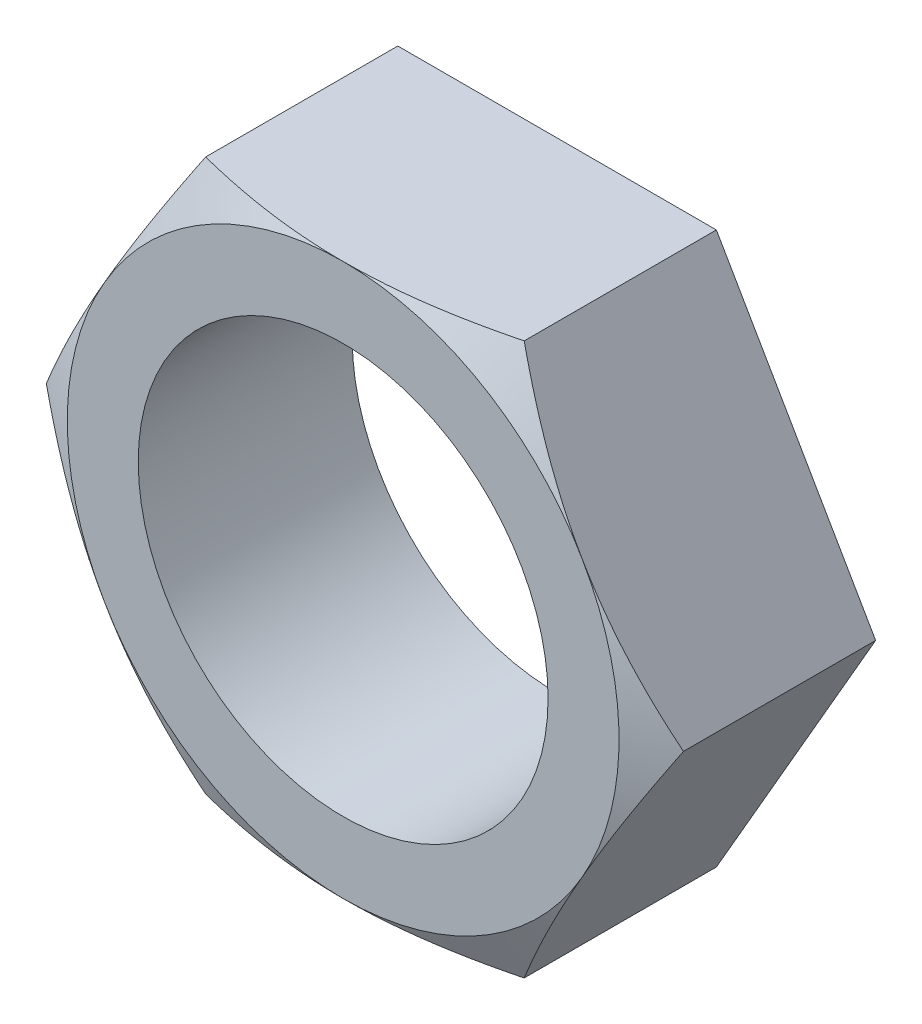
ISO-10303-21;
HEADER;
FILE_DESCRIPTION(('STEP AP214'),'2;1');
FILE_NAME('part.step','',(''),(''),'','','');
FILE_SCHEMA(('AUTOMOTIVE_DESIGN { 1 0 10303 214 1 1 1 1 }'));
ENDSEC;
DATA;
#1=APPLICATION_CONTEXT('core data for automotive mechanical design processes');
#2=APPLICATION_PROTOCOL_DEFINITION('international standard','automotive_design',2000,#1);
#3=PRODUCT_CONTEXT('',#1,'mechanical');
#4=PRODUCT('Part','Part','',(#3));
#5=PRODUCT_RELATED_PRODUCT_CATEGORY('part','',(#4));
#6=PRODUCT_DEFINITION_FORMATION('','',#4);
#7=PRODUCT_DEFINITION_CONTEXT('part definition',#1,'design');
#8=PRODUCT_DEFINITION('design','',#6,#7);
#9=PRODUCT_DEFINITION_SHAPE('','',#8);
#10=(LENGTH_UNIT() NAMED_UNIT(*) SI_UNIT(.MILLI.,.METRE.));
#11=(NAMED_UNIT(*) PLANE_ANGLE_UNIT() SI_UNIT($,.RADIAN.));
#12=(NAMED_UNIT(*) SI_UNIT($,.STERADIAN.) SOLID_ANGLE_UNIT());
#13=UNCERTAINTY_MEASURE_WITH_UNIT(LENGTH_MEASURE(1.E-05),#10,'distance_accuracy_value','');
#14=(GEOMETRIC_REPRESENTATION_CONTEXT(3) GLOBAL_UNCERTAINTY_ASSIGNED_CONTEXT((#13)) GLOBAL_UNIT_ASSIGNED_CONTEXT((#10,
#11,#12)) REPRESENTATION_CONTEXT('',''));
#15=CARTESIAN_POINT('',(0.,0.,0.));
#16=DIRECTION('',(0.,0.,1.));
#17=DIRECTION('',(1.,0.,0.));
#18=AXIS2_PLACEMENT_3D('',#15,#16,#17);
#19=CARTESIAN_POINT('',(147.07060395356,1381.2218281699,123.976608288254));
#20=DIRECTION('',(0.866025403784434,-0.500000000000007,0.));
#21=DIRECTION('',(0.500000000000007,0.866025403784434,0.));
#22=AXIS2_PLACEMENT_3D('',#19,#20,#21);
#23=PLANE('',#22);
#24=CARTESIAN_POINT('',(147.070719423614,1381.2220281699,21.3919278692892));
#25=CARTESIAN_POINT('',(146.580470792881,1380.37289263313,21.6417046290043));
#26=CARTESIAN_POINT('',(146.088283996036,1379.52040009418,21.8769733663679));
#27=CARTESIAN_POINT('',(145.099927293063,1377.80851606863,22.3137023874053));
#28=CARTESIAN_POINT('',(144.603755497762,1376.94912130988,22.5151455063238));
#29=CARTESIAN_POINT('',(143.607012208054,1375.22271129001,22.8794628681463));
#30=CARTESIAN_POINT('',(143.10643489137,1374.35568594439,23.0422741440836));
#31=CARTESIAN_POINT('',(142.102261938455,1372.61640737036,23.3240694413077));
#32=CARTESIAN_POINT('',(141.598666825295,1371.74415504792,23.4430608465895));
#33=CARTESIAN_POINT('',(140.600914799346,1370.01599784562,23.6310032152789));
#34=CARTESIAN_POINT('',(140.106810058655,1369.16018333049,23.7010513372338));
#35=CARTESIAN_POINT('',(139.117443596861,1367.44655035135,23.7929958306863));
#36=CARTESIAN_POINT('',(138.622181822608,1366.5887317953,23.8148899448458));
#37=CARTESIAN_POINT('',(137.632281032135,1364.87417333175,23.8096982247025));
#38=CARTESIAN_POINT('',(137.137641937828,1364.017433289,23.782667033308));
#39=CARTESIAN_POINT('',(136.14963623759,1362.30615721802,23.6807404823272));
#40=CARTESIAN_POINT('',(135.656269529059,1361.45162101208,23.6058491113049));
#41=CARTESIAN_POINT('',(134.919890015754,1360.17617428138,23.4600252252282));
#42=CARTESIAN_POINT('',(134.6760003469,1359.75374498349,23.4061148153264));
#43=CARTESIAN_POINT('',(134.188884668478,1358.9100358793,23.2876390773393));
#44=CARTESIAN_POINT('',(133.945658615883,1358.48875599848,23.2230744575704));
#45=CARTESIAN_POINT('',(133.21699643025,1357.22667607141,23.0140896973095));
#46=CARTESIAN_POINT('',(132.73264065915,1356.38774726692,22.8543916470237));
#47=CARTESIAN_POINT('',(131.761505215448,1354.7056913374,22.4964947671884));
#48=CARTESIAN_POINT('',(131.274766865267,1353.8626357849,22.2978544405525));
#49=CARTESIAN_POINT('',(130.30516492159,1352.18323595533,21.8680955136689));
#50=CARTESIAN_POINT('',(129.822299286033,1351.34688814132,21.6369954077479));
#51=CARTESIAN_POINT('',(129.341288483506,1350.51375299235,21.3919278692892));
#52=B_SPLINE_CURVE_WITH_KNOTS('',3,(#24,#25,#26,#27,#28,#29,#30,#31,#32,#33,#34,#35,#36,#37,#38,
#39,#40,#41,#42,#43,#44,#45,#46,#47,#48,#49,#50,#51),.UNSPECIFIED.,.F.,.F.,(4,2,2,2,2,2,2,2,2,2,
2,2,2,4),(0.,3.03558638203784,6.07270854259094,9.11474748966,12.1562735942813,15.1272181043355,
18.0983018817831,21.0660694103388,24.0335896438093,25.5057384868417,26.9777894974265,
29.922279495167,32.9023144399483,35.8806583121157),.UNSPECIFIED.);
#53=CARTESIAN_POINT('',(147.07060395356,1381.2218281699,21.3919867045077));
#54=VERTEX_POINT('',#53);
#55=CARTESIAN_POINT('',(138.20600395356,1365.86789058112,23.8125000000008));
#56=VERTEX_POINT('',#55);
#57=EDGE_CURVE('E121',#54,#56,#52,.T.);
#58=ORIENTED_EDGE('',*,*,#57,.F.);
#59=DIRECTION('',(0.,0.,-1.));
#60=VECTOR('',#59,1.);
#61=CARTESIAN_POINT('',(147.07060395356,1381.2218281699,123.976608288254));
#62=LINE('',#61,#60);
#63=CARTESIAN_POINT('',(147.07060395356,1381.2218281699,0.));
#64=VERTEX_POINT('',#63);
#65=EDGE_CURVE('E251',#54,#64,#62,.T.);
#66=ORIENTED_EDGE('',*,*,#65,.T.);
#67=DIRECTION('',(-0.500000000000007,-0.866025403784434,0.));
#68=VECTOR('',#67,1.);
#69=CARTESIAN_POINT('',(147.07060395356,1381.2218281699,0.));
#70=LINE('',#69,#68);
#71=CARTESIAN_POINT('',(129.34140395356,1350.51395299235,0.));
#72=VERTEX_POINT('',#71);
#73=EDGE_CURVE('E252',#64,#72,#70,.T.);
#74=ORIENTED_EDGE('',*,*,#73,.T.);
#75=DIRECTION('',(0.,0.,-1.));
#76=VECTOR('',#75,1.);
#77=CARTESIAN_POINT('',(129.34140395356,1350.51395299235,123.976608288254));
#78=LINE('',#77,#76);
#79=CARTESIAN_POINT('',(129.34140395356,1350.51395299235,21.3919867045076));
#80=VERTEX_POINT('',#79);
#81=EDGE_CURVE('E149',#80,#72,#78,.T.);
#82=ORIENTED_EDGE('',*,*,#81,.F.);
#83=EDGE_CURVE('E132',#56,#80,#52,.T.);
#84=ORIENTED_EDGE('',*,*,#83,.F.);
#85=EDGE_LOOP('',(#58,#66,#74,#82,#84));
#86=FACE_BOUND('',#85,.T.);
#87=ADVANCED_FACE('F49',(#86),#23,.F.);
#88=CARTESIAN_POINT('',(129.34140395356,1350.51395299235,123.976608288254));
#89=DIRECTION('',(0.866025403784442,0.499999999999994,0.));
#90=DIRECTION('',(-0.499999999999994,0.866025403784442,0.));
#91=AXIS2_PLACEMENT_3D('',#88,#89,#90);
#92=PLANE('',#91);
#93=CARTESIAN_POINT('',(129.341288483506,1350.51415299235,21.3919278692892));
#94=CARTESIAN_POINT('',(129.831537114238,1349.66501745558,21.6417046290042));
#95=CARTESIAN_POINT('',(130.323723911084,1348.81252491663,21.8769733663678));
#96=CARTESIAN_POINT('',(131.312080614057,1347.10064089108,22.3137023874053));
#97=CARTESIAN_POINT('',(131.808252409357,1346.24124613233,22.5151455063237));
#98=CARTESIAN_POINT('',(132.804995699065,1344.51483611246,22.8794628681462));
#99=CARTESIAN_POINT('',(133.30557301575,1343.64781076684,23.0422741440836));
#100=CARTESIAN_POINT('',(134.309745968665,1341.90853219281,23.3240694413077));
#101=CARTESIAN_POINT('',(134.813341081825,1341.03627987037,23.4430608465895));
#102=CARTESIAN_POINT('',(135.811093107774,1339.30812266807,23.6310032152788));
#103=CARTESIAN_POINT('',(136.305197848465,1338.45230815294,23.7010513372338));
#104=CARTESIAN_POINT('',(137.294564310259,1336.7386751738,23.7929958306862));
#105=CARTESIAN_POINT('',(137.789826084512,1335.88085661775,23.8148899448458));
#106=CARTESIAN_POINT('',(138.779726874984,1334.1662981542,23.8096982247025));
#107=CARTESIAN_POINT('',(139.274365969291,1333.30955811145,23.782667033308));
#108=CARTESIAN_POINT('',(140.26237166953,1331.59828204047,23.6807404823272));
#109=CARTESIAN_POINT('',(140.75573837806,1330.74374583453,23.6058491113049));
#110=CARTESIAN_POINT('',(141.492117891365,1329.46829910383,23.4600252252282));
#111=CARTESIAN_POINT('',(141.73600756022,1329.04586980594,23.4061148153264));
#112=CARTESIAN_POINT('',(142.223123238642,1328.20216070175,23.2876390773393));
#113=CARTESIAN_POINT('',(142.466349291236,1327.78088082093,23.2230744575704));
#114=CARTESIAN_POINT('',(143.195011476869,1326.51880089386,23.0140896973095));
#115=CARTESIAN_POINT('',(143.679367247969,1325.67987208937,22.8543916470237));
#116=CARTESIAN_POINT('',(144.650502691672,1323.99781615985,22.4964947671883));
#117=CARTESIAN_POINT('',(145.137241041852,1323.15476060735,22.2978544405525));
#118=CARTESIAN_POINT('',(146.10684298553,1321.47536077778,21.8680955136689));
#119=CARTESIAN_POINT('',(146.589708621086,1320.63901296377,21.6369954077479));
#120=CARTESIAN_POINT('',(147.070719423613,1319.8058778148,21.3919278692892));
#121=B_SPLINE_CURVE_WITH_KNOTS('',3,(#93,#94,#95,#96,#97,#98,#99,#100,#101,#102,#103,#104,#105,
#106,#107,#108,#109,#110,#111,#112,#113,#114,#115,#116,#117,#118,#119,#120),.UNSPECIFIED.,.F.,
.F.,(4,2,2,2,2,2,2,2,2,2,2,2,2,4),(0.,3.03558638203781,6.0727085425909,9.11474748965993,
12.1562735942812,15.1272181043356,18.0983018817832,21.0660694103389,24.0335896438094,
25.5057384868415,26.9777894974267,29.9222794951672,32.9023144399483,35.8806583121156),.UNSPECIFIED.);
#122=CARTESIAN_POINT('',(138.20600395356,1335.16001540357,23.8125000000008));
#123=VERTEX_POINT('',#122);
#124=EDGE_CURVE('E139',#80,#123,#121,.T.);
#125=ORIENTED_EDGE('',*,*,#124,.F.);
#126=ORIENTED_EDGE('',*,*,#81,.T.);
#127=DIRECTION('',(0.499999999999994,-0.866025403784442,0.));
#128=VECTOR('',#127,1.);
#129=CARTESIAN_POINT('',(129.34140395356,1350.51395299235,0.));
#130=LINE('',#129,#128);
#131=CARTESIAN_POINT('',(147.070603953559,1319.8060778148,0.));
#132=VERTEX_POINT('',#131);
#133=EDGE_CURVE('E267',#72,#132,#130,.T.);
#134=ORIENTED_EDGE('',*,*,#133,.T.);
#135=DIRECTION('',(0.,0.,-1.));
#136=VECTOR('',#135,1.);
#137=CARTESIAN_POINT('',(147.070603953559,1319.8060778148,123.976608288254));
#138=LINE('',#137,#136);
#139=CARTESIAN_POINT('',(147.070603953559,1319.8060778148,21.3919867045077));
#140=VERTEX_POINT('',#139);
#141=EDGE_CURVE('E222',#140,#132,#138,.T.);
#142=ORIENTED_EDGE('',*,*,#141,.F.);
#143=EDGE_CURVE('E150',#123,#140,#121,.T.);
#144=ORIENTED_EDGE('',*,*,#143,.F.);
#145=EDGE_LOOP('',(#125,#126,#134,#142,#144));
#146=FACE_BOUND('',#145,.T.);
#147=ADVANCED_FACE('F210',(#146),#92,.F.);
#148=CARTESIAN_POINT('',(147.070603953559,1319.8060778148,123.976608288254));
#149=DIRECTION('',(0.,1.,0.));
#150=DIRECTION('',(-1.,0.,0.));
#151=AXIS2_PLACEMENT_3D('',#148,#149,#150);
#152=PLANE('',#151);
#153=CARTESIAN_POINT('',(117.771709021794,1319.8060778148,10.8409567621768));
#154=CARTESIAN_POINT('',(118.456911807854,1319.8060778148,11.1332749209905));
#155=CARTESIAN_POINT('',(119.142799303296,1319.8060778148,11.4239930974424));
#156=CARTESIAN_POINT('',(120.516086699451,1319.8060778148,12.001852866436));
#157=CARTESIAN_POINT('',(121.203486614713,1319.8060778148,12.2889944243928));
#158=CARTESIAN_POINT('',(122.580027360718,1319.8060778148,12.8593595943776));
#159=CARTESIAN_POINT('',(123.269168427127,1319.8060778148,13.1425826382681));
#160=CARTESIAN_POINT('',(124.649244401776,1319.8060778148,13.7046161150412));
#161=CARTESIAN_POINT('',(125.340179305927,1319.8060778148,13.9834265579677));
#162=CARTESIAN_POINT('',(127.421796474031,1319.8060778148,14.8148516356537));
#163=CARTESIAN_POINT('',(128.815462549204,1319.8060778148,15.3600354664249));
#164=CARTESIAN_POINT('',(131.612197010711,1319.8060778148,16.42563880378));
#165=CARTESIAN_POINT('',(133.0152650062,1319.8060778148,16.9460593325986));
#166=CARTESIAN_POINT('',(135.823309352538,1319.8060778148,17.9522574166504));
#167=CARTESIAN_POINT('',(137.228211056339,1319.8060778148,18.4382422110898));
#168=CARTESIAN_POINT('',(140.0511762563,1319.8060778148,19.3710139959994));
#169=CARTESIAN_POINT('',(141.469240674678,1319.8060778148,19.8177982166875));
#170=CARTESIAN_POINT('',(144.31828348994,1319.8060778148,20.6608160664175));
#171=CARTESIAN_POINT('',(145.749241074345,1319.8060778148,21.0571194547956));
#172=CARTESIAN_POINT('',(148.627149973403,1319.8060778148,21.7866205817215));
#173=CARTESIAN_POINT('',(150.074098105683,1319.8060778148,22.1198306457246));
#174=CARTESIAN_POINT('',(152.430331648247,1319.8060778148,22.5960899015803));
#175=CARTESIAN_POINT('',(153.334752254528,1319.8060778148,22.7632580244041));
#176=CARTESIAN_POINT('',(155.149219008547,1319.8060778148,23.0638467167844));
#177=CARTESIAN_POINT('',(156.059265017458,1319.8060778148,23.197268115783));
#178=CARTESIAN_POINT('',(157.883835527958,1319.8060778148,23.42691192005));
#179=CARTESIAN_POINT('',(158.798358805228,1319.8060778148,23.5231439759794));
#180=CARTESIAN_POINT('',(160.630757944938,1319.8060778148,23.6756764225213));
#181=CARTESIAN_POINT('',(161.548633791425,1319.8060778148,23.7319770028961));
#182=CARTESIAN_POINT('',(163.386507442713,1319.8060778148,23.8029000926338));
#183=CARTESIAN_POINT('',(164.306506126316,1319.8060778148,23.8175000573444));
#184=CARTESIAN_POINT('',(166.146199021455,1319.8060778148,23.8044811571944));
#185=CARTESIAN_POINT('',(167.0658932338,1319.8060778148,23.7768624054369));
#186=CARTESIAN_POINT('',(168.902986176128,1319.8060778148,23.6803064355593));
#187=CARTESIAN_POINT('',(169.8203851506,1319.8060778148,23.6113738243276));
#188=CARTESIAN_POINT('',(171.651374475858,1319.8060778148,23.4343128406343));
#189=CARTESIAN_POINT('',(172.564964743128,1319.8060778148,23.3261836132155));
#190=CARTESIAN_POINT('',(174.447081201838,1319.8060778148,23.0654414898965));
#191=CARTESIAN_POINT('',(175.415264447843,1319.8060778148,22.9103687047686));
#192=CARTESIAN_POINT('',(177.345078154972,1319.8060778148,22.5634158118414));
#193=CARTESIAN_POINT('',(178.306707777592,1319.8060778148,22.3715310823994));
#194=CARTESIAN_POINT('',(180.223431339038,1319.8060778148,21.9553572065387));
#195=CARTESIAN_POINT('',(181.178521416784,1319.8060778148,21.7310503993854));
#196=CARTESIAN_POINT('',(183.081624184154,1319.8060778148,21.2544637660428));
#197=CARTESIAN_POINT('',(184.029637085254,1319.8060778148,21.0021847793025));
#198=CARTESIAN_POINT('',(185.923233455325,1319.8060778148,20.4724108102008));
#199=CARTESIAN_POINT('',(186.868785994329,1319.8060778148,20.1948058011185));
#200=CARTESIAN_POINT('',(188.753554148018,1319.8060778148,19.6189165178223));
#201=CARTESIAN_POINT('',(189.69276971916,1319.8060778148,19.3206321016725));
#202=CARTESIAN_POINT('',(191.565169477271,1319.8060778148,18.7065206757264));
#203=CARTESIAN_POINT('',(192.498355112009,1319.8060778148,18.3906980658482));
#204=CARTESIAN_POINT('',(194.359492154287,1319.8060778148,17.7440384241465));
#205=CARTESIAN_POINT('',(195.287443579258,1319.8060778148,17.4132014423559));
#206=CARTESIAN_POINT('',(197.155106522538,1319.8060778148,16.7327061537367));
#207=CARTESIAN_POINT('',(198.094734079441,1319.8060778148,16.3828178891692));
#208=CARTESIAN_POINT('',(199.969673141043,1319.8060778148,15.6716813356268));
#209=CARTESIAN_POINT('',(200.904984642862,1319.8060778148,15.3104330390735));
#210=CARTESIAN_POINT('',(202.771843288172,1319.8060778148,14.5781611036866));
#211=CARTESIAN_POINT('',(203.703390162497,1319.8060778148,14.2071367796587));
#212=CARTESIAN_POINT('',(205.563092524498,1319.8060778148,13.4566813214079));
#213=CARTESIAN_POINT('',(206.491247995723,1319.8060778148,13.077250146469));
#214=CARTESIAN_POINT('',(208.333979859002,1319.8060778148,12.315478714202));
#215=CARTESIAN_POINT('',(209.248590400054,1319.8060778148,11.9332209761225));
#216=CARTESIAN_POINT('',(211.075196808108,1319.8060778148,11.1625061136868));
#217=CARTESIAN_POINT('',(211.987192667534,1319.8060778148,10.7740489713897));
#218=CARTESIAN_POINT('',(213.808628287385,1319.8060778148,9.99181335755288));
#219=CARTESIAN_POINT('',(214.718068627817,1319.8060778148,9.59803623533003));
#220=CARTESIAN_POINT('',(216.534853269485,1319.8060778148,8.80570673741764));
#221=CARTESIAN_POINT('',(217.442197597948,1319.8060778148,8.4071544241762));
#222=CARTESIAN_POINT('',(218.348621829151,1319.8060778148,8.00652975555705));
#223=B_SPLINE_CURVE_WITH_KNOTS('',3,(#153,#154,#155,#156,#157,#158,#159,#160,#161,#162,#163,
#164,#165,#166,#167,#168,#169,#170,#171,#172,#173,#174,#175,#176,#177,#178,#179,#180,#181,#182,
#183,#184,#185,#186,#187,#188,#189,#190,#191,#192,#193,#194,#195,#196,#197,#198,#199,#200,#201,
#202,#203,#204,#205,#206,#207,#208,#209,#210,#211,#212,#213,#214,#215,#216,#217,#218,#219,#220,
#221,#222),.UNSPECIFIED.,.F.,.F.,(4,2,2,2,2,2,2,2,2,2,2,2,2,2,2,2,2,2,2,2,2,2,2,2,2,2,2,2,2,2,2,
2,2,2,4),(0.,2.23485528231573,4.46973215830187,6.70492973875985,8.94012223073118,
13.4294441241623,17.9185805363038,22.3778839899908,26.8375022699264,31.2908893679087,
35.7434055848097,38.502087477098,41.2607015586652,44.0185992964405,46.7764839280523,
49.5358592760823,52.2952272318193,55.0542875490125,57.8134080504882,60.75417212283,
63.695305642251,66.6380473160167,69.5807007015746,72.536809519837,75.4929386297673,
78.4483294381269,81.4037103988812,84.4115968271565,87.4194852620602,90.4275850813453,
93.43569947263,96.4095096949025,99.3833285249037,102.356406754815,105.329446146312),.UNSPECIFIED.);
#224=CARTESIAN_POINT('',(164.79980395356,1319.8060778148,23.8125000000008));
#225=VERTEX_POINT('',#224);
#226=EDGE_CURVE('E205',#140,#225,#223,.T.);
#227=ORIENTED_EDGE('',*,*,#226,.F.);
#228=ORIENTED_EDGE('',*,*,#141,.T.);
#229=DIRECTION('',(1.,0.,0.));
#230=VECTOR('',#229,1.);
#231=CARTESIAN_POINT('',(147.070603953559,1319.8060778148,0.));
#232=LINE('',#231,#230);
#233=CARTESIAN_POINT('',(182.529003953559,1319.8060778148,0.));
#234=VERTEX_POINT('',#233);
#235=EDGE_CURVE('E235',#132,#234,#232,.T.);
#236=ORIENTED_EDGE('',*,*,#235,.T.);
#237=DIRECTION('',(0.,0.,-1.));
#238=VECTOR('',#237,1.);
#239=CARTESIAN_POINT('',(182.529003953559,1319.8060778148,123.976608288254));
#240=LINE('',#239,#238);
#241=CARTESIAN_POINT('',(182.529003953559,1319.8060778148,21.3919867045078));
#242=VERTEX_POINT('',#241);
#243=EDGE_CURVE('E233',#242,#234,#240,.T.);
#244=ORIENTED_EDGE('',*,*,#243,.F.);
#245=EDGE_CURVE('E199',#225,#242,#223,.T.);
#246=ORIENTED_EDGE('',*,*,#245,.F.);
#247=EDGE_LOOP('',(#227,#228,#236,#244,#246));
#248=FACE_BOUND('',#247,.T.);
#249=ADVANCED_FACE('F206',(#248),#152,.F.);
#250=CARTESIAN_POINT('',(182.529003953559,1319.8060778148,123.976608288254));
#251=DIRECTION('',(-0.866025403784435,0.500000000000006,0.));
#252=DIRECTION('',(-0.500000000000006,-0.866025403784435,0.));
#253=AXIS2_PLACEMENT_3D('',#250,#251,#252);
#254=PLANE('',#253);
#255=CARTESIAN_POINT('',(182.528888483506,1319.8058778148,21.3919278692893));
#256=CARTESIAN_POINT('',(183.019137114238,1320.65501335157,21.6417046290044));
#257=CARTESIAN_POINT('',(183.511323911084,1321.50750589052,21.8769733663679));
#258=CARTESIAN_POINT('',(184.499680614056,1323.21938991607,22.3137023874054));
#259=CARTESIAN_POINT('',(184.995852409357,1324.07878467481,22.5151455063238));
#260=CARTESIAN_POINT('',(185.992595699065,1325.80519469469,22.8794628681464));
#261=CARTESIAN_POINT('',(186.49317301575,1326.6722200403,23.0422741440837));
#262=CARTESIAN_POINT('',(187.497345968665,1328.41149861434,23.3240694413079));
#263=CARTESIAN_POINT('',(188.000941081824,1329.28375093678,23.4430608465896));
#264=CARTESIAN_POINT('',(188.998693107774,1331.01190813907,23.631003215279));
#265=CARTESIAN_POINT('',(189.492797848464,1331.86772265421,23.701051337234));
#266=CARTESIAN_POINT('',(190.482164310258,1333.58135563334,23.7929958306865));
#267=CARTESIAN_POINT('',(190.977426084511,1334.4391741894,23.814889944846));
#268=CARTESIAN_POINT('',(191.967326874984,1336.15373265295,23.8096982247027));
#269=CARTESIAN_POINT('',(192.461965969291,1337.0104726957,23.7826670333082));
#270=CARTESIAN_POINT('',(193.44997166953,1338.72174876668,23.6807404823274));
#271=CARTESIAN_POINT('',(193.94333837806,1339.57628497262,23.6058491113051));
#272=CARTESIAN_POINT('',(194.679717891365,1340.85173170331,23.4600252252285));
#273=CARTESIAN_POINT('',(194.923607560219,1341.27416100121,23.4061148153266));
#274=CARTESIAN_POINT('',(195.410723238642,1342.1178701054,23.2876390773395));
#275=CARTESIAN_POINT('',(195.653949291236,1342.53914998622,23.2230744575706));
#276=CARTESIAN_POINT('',(196.38261147687,1343.80122991329,23.0140896973097));
#277=CARTESIAN_POINT('',(196.866967247969,1344.64015871777,22.8543916470239));
#278=CARTESIAN_POINT('',(197.838102691672,1346.3222146473,22.4964947671886));
#279=CARTESIAN_POINT('',(198.324841041852,1347.1652701998,22.2978544405527));
#280=CARTESIAN_POINT('',(199.29444298553,1348.84467002937,21.8680955136691));
#281=CARTESIAN_POINT('',(199.777308621086,1349.68101784338,21.6369954077481));
#282=CARTESIAN_POINT('',(200.258319423613,1350.51415299235,21.3919278692894));
#283=B_SPLINE_CURVE_WITH_KNOTS('',3,(#255,#256,#257,#258,#259,#260,#261,#262,#263,#264,#265,
#266,#267,#268,#269,#270,#271,#272,#273,#274,#275,#276,#277,#278,#279,#280,#281,#282),
.UNSPECIFIED.,.F.,.F.,(4,2,2,2,2,2,2,2,2,2,2,2,2,4),(0.,3.03558638203759,6.07270854259068,
9.11474748965951,12.1562735942811,15.1272181043353,18.0983018817828,21.0660694103388,
24.0335896438093,25.5057384868417,26.9777894974268,29.9222794951672,32.9023144399485,
35.8806583121159),.UNSPECIFIED.);
#284=CARTESIAN_POINT('',(191.39360395356,1335.16001540357,23.8125000000008));
#285=VERTEX_POINT('',#284);
#286=EDGE_CURVE('E73',#242,#285,#283,.T.);
#287=ORIENTED_EDGE('',*,*,#286,.F.);
#288=ORIENTED_EDGE('',*,*,#243,.T.);
#289=DIRECTION('',(0.500000000000006,0.866025403784435,0.));
#290=VECTOR('',#289,1.);
#291=CARTESIAN_POINT('',(182.529003953559,1319.8060778148,0.));
#292=LINE('',#291,#290);
#293=CARTESIAN_POINT('',(200.25820395356,1350.51395299235,0.));
#294=VERTEX_POINT('',#293);
#295=EDGE_CURVE('E239',#234,#294,#292,.T.);
#296=ORIENTED_EDGE('',*,*,#295,.T.);
#297=DIRECTION('',(0.,0.,-1.));
#298=VECTOR('',#297,1.);
#299=CARTESIAN_POINT('',(200.25820395356,1350.51395299235,123.976608288254));
#300=LINE('',#299,#298);
#301=CARTESIAN_POINT('',(200.25820395356,1350.51395299235,21.3919867045078));
#302=VERTEX_POINT('',#301);
#303=EDGE_CURVE('E241',#302,#294,#300,.T.);
#304=ORIENTED_EDGE('',*,*,#303,.F.);
#305=EDGE_CURVE('E193',#285,#302,#283,.T.);
#306=ORIENTED_EDGE('',*,*,#305,.F.);
#307=EDGE_LOOP('',(#287,#288,#296,#304,#306));
#308=FACE_BOUND('',#307,.T.);
#309=ADVANCED_FACE('F209',(#308),#254,.F.);
#310=CARTESIAN_POINT('',(200.25820395356,1350.51395299235,123.976608288254));
#311=DIRECTION('',(-0.866025403784442,-0.499999999999994,0.));
#312=DIRECTION('',(0.499999999999994,-0.866025403784442,0.));
#313=AXIS2_PLACEMENT_3D('',#310,#311,#312);
#314=PLANE('',#313);
#315=CARTESIAN_POINT('',(200.258319423613,1350.51375299235,21.3919278692894));
#316=CARTESIAN_POINT('',(199.768070792881,1351.36288852912,21.6417046290044));
#317=CARTESIAN_POINT('',(199.275883996035,1352.21538106807,21.8769733663679));
#318=CARTESIAN_POINT('',(198.287527293063,1353.92726509362,22.3137023874054));
#319=CARTESIAN_POINT('',(197.791355497762,1354.78665985236,22.5151455063238));
#320=CARTESIAN_POINT('',(196.794612208054,1356.51306987224,22.8794628681463));
#321=CARTESIAN_POINT('',(196.29403489137,1357.38009521785,23.0422741440837));
#322=CARTESIAN_POINT('',(195.289861938454,1359.11937379189,23.3240694413078));
#323=CARTESIAN_POINT('',(194.786266825295,1359.99162611433,23.4430608465896));
#324=CARTESIAN_POINT('',(193.788514799345,1361.71978331663,23.631003215279));
#325=CARTESIAN_POINT('',(193.294410058655,1362.57559783176,23.7010513372339));
#326=CARTESIAN_POINT('',(192.305043596861,1364.28923081089,23.7929958306864));
#327=CARTESIAN_POINT('',(191.809781822608,1365.14704936695,23.8148899448459));
#328=CARTESIAN_POINT('',(190.819881032135,1366.8616078305,23.8096982247026));
#329=CARTESIAN_POINT('',(190.325241937828,1367.71834787325,23.782667033308));
#330=CARTESIAN_POINT('',(189.337236237589,1369.42962394423,23.6807404823272));
#331=CARTESIAN_POINT('',(188.843869529059,1370.28416015017,23.6058491113049));
#332=CARTESIAN_POINT('',(188.107490015754,1371.55960688086,23.4600252252283));
#333=CARTESIAN_POINT('',(187.8636003469,1371.98203617876,23.4061148153265));
#334=CARTESIAN_POINT('',(187.376484668478,1372.82574528295,23.2876390773393));
#335=CARTESIAN_POINT('',(187.133258615883,1373.24702516377,23.2230744575704));
#336=CARTESIAN_POINT('',(186.40459643025,1374.50910509084,23.0140896973096));
#337=CARTESIAN_POINT('',(185.92024065915,1375.34803389532,22.8543916470237));
#338=CARTESIAN_POINT('',(184.949105215448,1377.03008982485,22.4964947671884));
#339=CARTESIAN_POINT('',(184.462366865268,1377.87314537735,22.2978544405526));
#340=CARTESIAN_POINT('',(183.49276492159,1379.55254520692,21.868095513669));
#341=CARTESIAN_POINT('',(183.009899286034,1380.38889302093,21.636995407748));
#342=CARTESIAN_POINT('',(182.528888483506,1381.2220281699,21.3919278692893));
#343=B_SPLINE_CURVE_WITH_KNOTS('',3,(#315,#316,#317,#318,#319,#320,#321,#322,#323,#324,#325,
#326,#327,#328,#329,#330,#331,#332,#333,#334,#335,#336,#337,#338,#339,#340,#341,#342),
.UNSPECIFIED.,.F.,.F.,(4,2,2,2,2,2,2,2,2,2,2,2,2,4),(0.,3.03558638203755,6.07270854259063,
9.11474748965968,12.1562735942812,15.1272181043356,18.0983018817832,21.0660694103389,
24.0335896438094,25.5057384868417,26.9777894974267,29.9222794951669,32.902314439948,
35.8806583121153),.UNSPECIFIED.);
#344=CARTESIAN_POINT('',(191.39360395356,1365.86789058112,23.8125000000008));
#345=VERTEX_POINT('',#344);
#346=EDGE_CURVE('E65',#302,#345,#343,.T.);
#347=ORIENTED_EDGE('',*,*,#346,.F.);
#348=ORIENTED_EDGE('',*,*,#303,.T.);
#349=DIRECTION('',(-0.499999999999994,0.866025403784442,0.));
#350=VECTOR('',#349,1.);
#351=CARTESIAN_POINT('',(200.25820395356,1350.51395299235,0.));
#352=LINE('',#351,#350);
#353=CARTESIAN_POINT('',(182.52900395356,1381.2218281699,0.));
#354=VERTEX_POINT('',#353);
#355=EDGE_CURVE('E248',#294,#354,#352,.T.);
#356=ORIENTED_EDGE('',*,*,#355,.T.);
#357=DIRECTION('',(0.,0.,-1.));
#358=VECTOR('',#357,1.);
#359=CARTESIAN_POINT('',(182.52900395356,1381.2218281699,123.976608288254));
#360=LINE('',#359,#358);
#361=CARTESIAN_POINT('',(182.52900395356,1381.2218281699,21.3919867045077));
#362=VERTEX_POINT('',#361);
#363=EDGE_CURVE('E249',#362,#354,#360,.T.);
#364=ORIENTED_EDGE('',*,*,#363,.F.);
#365=EDGE_CURVE('E185',#345,#362,#343,.T.);
#366=ORIENTED_EDGE('',*,*,#365,.F.);
#367=EDGE_LOOP('',(#347,#348,#356,#364,#366));
#368=FACE_BOUND('',#367,.T.);
#369=ADVANCED_FACE('F287',(#368),#314,.F.);
#370=CARTESIAN_POINT('',(182.52900395356,1381.2218281699,123.976608288254));
#371=DIRECTION('',(0.,-1.,0.));
#372=DIRECTION('',(1.,0.,0.));
#373=AXIS2_PLACEMENT_3D('',#370,#371,#372);
#374=PLANE('',#373);
#375=CARTESIAN_POINT('',(117.771709021795,1381.2218281699,10.8409567621768));
#376=CARTESIAN_POINT('',(118.456911807854,1381.2218281699,11.1332749209905));
#377=CARTESIAN_POINT('',(119.142799303296,1381.2218281699,11.4239930974424));
#378=CARTESIAN_POINT('',(120.516086699451,1381.2218281699,12.001852866436));
#379=CARTESIAN_POINT('',(121.203486614713,1381.2218281699,12.2889944243928));
#380=CARTESIAN_POINT('',(122.580027360718,1381.2218281699,12.8593595943776));
#381=CARTESIAN_POINT('',(123.269168427128,1381.2218281699,13.1425826382682));
#382=CARTESIAN_POINT('',(124.649244401776,1381.2218281699,13.7046161150412));
#383=CARTESIAN_POINT('',(125.340179305927,1381.2218281699,13.9834265579677));
#384=CARTESIAN_POINT('',(127.421796474032,1381.2218281699,14.8148516356538));
#385=CARTESIAN_POINT('',(128.815462549204,1381.2218281699,15.3600354664249));
#386=CARTESIAN_POINT('',(131.612197010712,1381.2218281699,16.42563880378));
#387=CARTESIAN_POINT('',(133.0152650062,1381.2218281699,16.9460593325986));
#388=CARTESIAN_POINT('',(135.823309352538,1381.2218281699,17.9522574166504));
#389=CARTESIAN_POINT('',(137.22821105634,1381.2218281699,18.4382422110898));
#390=CARTESIAN_POINT('',(140.051176256301,1381.2218281699,19.3710139959995));
#391=CARTESIAN_POINT('',(141.469240674678,1381.2218281699,19.8177982166876));
#392=CARTESIAN_POINT('',(144.31828348994,1381.2218281699,20.6608160664175));
#393=CARTESIAN_POINT('',(145.749241074345,1381.2218281699,21.0571194547956));
#394=CARTESIAN_POINT('',(148.627149973403,1381.2218281699,21.7866205817215));
#395=CARTESIAN_POINT('',(150.074098105684,1381.2218281699,22.1198306457246));
#396=CARTESIAN_POINT('',(152.430331648247,1381.2218281699,22.5960899015803));
#397=CARTESIAN_POINT('',(153.334752254528,1381.2218281699,22.7632580244041));
#398=CARTESIAN_POINT('',(155.149219008547,1381.2218281699,23.0638467167844));
#399=CARTESIAN_POINT('',(156.059265017458,1381.2218281699,23.197268115783));
#400=CARTESIAN_POINT('',(157.883835527958,1381.2218281699,23.42691192005));
#401=CARTESIAN_POINT('',(158.798358805228,1381.2218281699,23.5231439759794));
#402=CARTESIAN_POINT('',(160.630757944938,1381.2218281699,23.6756764225213));
#403=CARTESIAN_POINT('',(161.548633791425,1381.2218281699,23.7319770028961));
#404=CARTESIAN_POINT('',(163.386507442713,1381.2218281699,23.8029000926338));
#405=CARTESIAN_POINT('',(164.306506126316,1381.2218281699,23.8175000573444));
#406=CARTESIAN_POINT('',(166.146199021456,1381.2218281699,23.8044811571944));
#407=CARTESIAN_POINT('',(167.0658932338,1381.2218281699,23.7768624054369));
#408=CARTESIAN_POINT('',(168.902986176129,1381.2218281699,23.6803064355593));
#409=CARTESIAN_POINT('',(169.820385150601,1381.2218281699,23.6113738243276));
#410=CARTESIAN_POINT('',(171.651374475858,1381.2218281699,23.4343128406343));
#411=CARTESIAN_POINT('',(172.564964743128,1381.2218281699,23.3261836132155));
#412=CARTESIAN_POINT('',(174.447081201839,1381.2218281699,23.0654414898965));
#413=CARTESIAN_POINT('',(175.415264447844,1381.2218281699,22.9103687047686));
#414=CARTESIAN_POINT('',(177.345078154973,1381.2218281699,22.5634158118414));
#415=CARTESIAN_POINT('',(178.306707777592,1381.2218281699,22.3715310823994));
#416=CARTESIAN_POINT('',(180.223431339039,1381.2218281699,21.9553572065387));
#417=CARTESIAN_POINT('',(181.178521416784,1381.2218281699,21.7310503993854));
#418=CARTESIAN_POINT('',(183.081624184154,1381.2218281699,21.2544637660428));
#419=CARTESIAN_POINT('',(184.029637085255,1381.2218281699,21.0021847793025));
#420=CARTESIAN_POINT('',(185.923233455326,1381.2218281699,20.4724108102008));
#421=CARTESIAN_POINT('',(186.868785994329,1381.2218281699,20.1948058011185));
#422=CARTESIAN_POINT('',(188.753554148018,1381.2218281699,19.6189165178223));
#423=CARTESIAN_POINT('',(189.692769719161,1381.2218281699,19.3206321016724));
#424=CARTESIAN_POINT('',(191.565169477271,1381.2218281699,18.7065206757263));
#425=CARTESIAN_POINT('',(192.498355112009,1381.2218281699,18.3906980658481));
#426=CARTESIAN_POINT('',(194.359492154287,1381.2218281699,17.7440384241465));
#427=CARTESIAN_POINT('',(195.287443579258,1381.2218281699,17.4132014423558));
#428=CARTESIAN_POINT('',(197.155106522539,1381.2218281699,16.7327061537366));
#429=CARTESIAN_POINT('',(198.094734079442,1381.2218281699,16.3828178891691));
#430=CARTESIAN_POINT('',(199.969673141043,1381.2218281699,15.6716813356267));
#431=CARTESIAN_POINT('',(200.904984642862,1381.2218281699,15.3104330390734));
#432=CARTESIAN_POINT('',(202.771843288172,1381.2218281699,14.5781611036865));
#433=CARTESIAN_POINT('',(203.703390162498,1381.2218281699,14.2071367796586));
#434=CARTESIAN_POINT('',(205.563092524499,1381.2218281699,13.4566813214078));
#435=CARTESIAN_POINT('',(206.491247995724,1381.2218281699,13.0772501464689));
#436=CARTESIAN_POINT('',(208.333979859002,1381.2218281699,12.3154787142019));
#437=CARTESIAN_POINT('',(209.248590400054,1381.2218281699,11.9332209761224));
#438=CARTESIAN_POINT('',(211.075196808109,1381.2218281699,11.1625061136867));
#439=CARTESIAN_POINT('',(211.987192667535,1381.2218281699,10.7740489713895));
#440=CARTESIAN_POINT('',(213.808628287386,1381.2218281699,9.99181335755276));
#441=CARTESIAN_POINT('',(214.718068627818,1381.2218281699,9.5980362353299));
#442=CARTESIAN_POINT('',(216.534853269486,1381.2218281699,8.80570673741751));
#443=CARTESIAN_POINT('',(217.442197597948,1381.2218281699,8.40715442417606));
#444=CARTESIAN_POINT('',(218.348621829152,1381.2218281699,8.00652975555691));
#445=B_SPLINE_CURVE_WITH_KNOTS('',3,(#375,#376,#377,#378,#379,#380,#381,#382,#383,#384,#385,
#386,#387,#388,#389,#390,#391,#392,#393,#394,#395,#396,#397,#398,#399,#400,#401,#402,#403,#404,
#405,#406,#407,#408,#409,#410,#411,#412,#413,#414,#415,#416,#417,#418,#419,#420,#421,#422,#423,
#424,#425,#426,#427,#428,#429,#430,#431,#432,#433,#434,#435,#436,#437,#438,#439,#440,#441,#442,
#443,#444),.UNSPECIFIED.,.F.,.F.,(4,2,2,2,2,2,2,2,2,2,2,2,2,2,2,2,2,2,2,2,2,2,2,2,2,2,2,2,2,2,2,
2,2,2,4),(0.,2.23485528231572,4.46973215830187,6.70492973875983,8.94012223073115,
13.4294441241622,17.9185805363038,22.3778839899907,26.8375022699263,31.2908893679087,
35.7434055848097,38.502087477098,41.2607015586651,44.0185992964405,46.7764839280523,
49.5358592760823,52.2952272318192,55.0542875490125,57.8134080504881,60.7541721228299,
63.6953056422509,66.6380473160167,69.5807007015746,72.536809519837,75.4929386297674,
78.448329438127,81.4037103988813,84.4115968271566,87.4194852620604,90.4275850813455,
93.4356994726302,96.4095096949027,99.3833285249039,102.356406754815,105.329446146313),.UNSPECIFIED.);
#446=CARTESIAN_POINT('',(164.79980395356,1381.2218281699,23.8125000000008));
#447=VERTEX_POINT('',#446);
#448=EDGE_CURVE('E383',#362,#447,#445,.F.);
#449=ORIENTED_EDGE('',*,*,#448,.F.);
#450=ORIENTED_EDGE('',*,*,#363,.T.);
#451=DIRECTION('',(-1.,0.,0.));
#452=VECTOR('',#451,1.);
#453=CARTESIAN_POINT('',(182.52900395356,1381.2218281699,0.));
#454=LINE('',#453,#452);
#455=EDGE_CURVE('E165',#354,#64,#454,.T.);
#456=ORIENTED_EDGE('',*,*,#455,.T.);
#457=ORIENTED_EDGE('',*,*,#65,.F.);
#458=EDGE_CURVE('E127',#447,#54,#445,.F.);
#459=ORIENTED_EDGE('',*,*,#458,.F.);
#460=EDGE_LOOP('',(#449,#450,#456,#457,#459));
#461=FACE_BOUND('',#460,.T.);
#462=ADVANCED_FACE('F261',(#461),#374,.F.);
#463=CARTESIAN_POINT('',(164.79980395356,2028.05100619533,23.8125000000008));
#464=DIRECTION('',(0.,0.,-1.));
#465=DIRECTION('',(-1.,0.,0.));
#466=AXIS2_PLACEMENT_3D('',#463,#464,#465);
#467=PLANE('',#466);
#468=CARTESIAN_POINT('',(164.79980395356,1350.51395299235,23.8125000000008));
#469=DIRECTION('',(0.,0.,-1.));
#470=DIRECTION('',(-1.,0.,0.));
#471=AXIS2_PLACEMENT_3D('',#468,#469,#470);
#472=CIRCLE('',#471,22.8092000000001);
#473=CARTESIAN_POINT('',(141.99060395356,1350.51395299235,23.8125000000008));
#474=VERTEX_POINT('',#473);
#475=EDGE_CURVE('E144',#474,#474,#472,.T.);
#476=ORIENTED_EDGE('',*,*,#475,.T.);
#477=EDGE_LOOP('',(#476));
#478=FACE_BOUND('',#477,.T.);
#479=CARTESIAN_POINT('',(164.79980395356,1350.51395299235,23.8125000000008));
#480=DIRECTION('',(0.,0.,-1.));
#481=DIRECTION('',(-1.,0.,0.));
#482=AXIS2_PLACEMENT_3D('',#479,#480,#481);
#483=CIRCLE('',#482,30.7078751775504);
#484=EDGE_CURVE('E14',#56,#447,#483,.T.);
#485=ORIENTED_EDGE('',*,*,#484,.F.);
#486=EDGE_CURVE('E53',#123,#56,#483,.T.);
#487=ORIENTED_EDGE('',*,*,#486,.F.);
#488=EDGE_CURVE('E143',#225,#123,#483,.T.);
#489=ORIENTED_EDGE('',*,*,#488,.F.);
#490=EDGE_CURVE('E228',#285,#225,#483,.T.);
#491=ORIENTED_EDGE('',*,*,#490,.F.);
#492=EDGE_CURVE('E58',#345,#285,#483,.T.);
#493=ORIENTED_EDGE('',*,*,#492,.F.);
#494=CARTESIAN_POINT('',(164.79980395356,1350.51395299235,23.8125000000008));
#495=DIRECTION('',(0.,0.,1.));
#496=DIRECTION('',(1.,0.,0.));
#497=AXIS2_PLACEMENT_3D('',#494,#495,#496);
#498=CIRCLE('',#497,30.7078751775504);
#499=EDGE_CURVE('E146',#345,#447,#498,.T.);
#500=ORIENTED_EDGE('',*,*,#499,.T.);
#501=EDGE_LOOP('',(#485,#487,#489,#491,#493,#500));
#502=FACE_BOUND('',#501,.T.);
#503=ADVANCED_FACE('F51',(#478,#502),#467,.F.);
#504=CARTESIAN_POINT('',(0.,0.,0.));
#505=DIRECTION('',(0.,0.,1.));
#506=DIRECTION('',(1.,0.,0.));
#507=AXIS2_PLACEMENT_3D('',#504,#505,#506);
#508=PLANE('',#507);
#509=ORIENTED_EDGE('',*,*,#73,.F.);
#510=ORIENTED_EDGE('',*,*,#455,.F.);
#511=ORIENTED_EDGE('',*,*,#355,.F.);
#512=ORIENTED_EDGE('',*,*,#295,.F.);
#513=ORIENTED_EDGE('',*,*,#235,.F.);
#514=ORIENTED_EDGE('',*,*,#133,.F.);
#515=EDGE_LOOP('',(#509,#510,#511,#512,#513,#514));
#516=FACE_BOUND('',#515,.T.);
#517=CARTESIAN_POINT('',(164.79980395356,1350.51395299235,0.));
#518=DIRECTION('',(0.,0.,1.));
#519=DIRECTION('',(1.,0.,0.));
#520=AXIS2_PLACEMENT_3D('',#517,#518,#519);
#521=CIRCLE('',#520,22.8092000000001);
#522=CARTESIAN_POINT('',(187.60900395356,1350.51395299235,0.));
#523=VERTEX_POINT('',#522);
#524=EDGE_CURVE('E131',#523,#523,#521,.T.);
#525=ORIENTED_EDGE('',*,*,#524,.T.);
#526=EDGE_LOOP('',(#525));
#527=FACE_BOUND('',#526,.T.);
#528=ADVANCED_FACE('F172',(#516,#527),#508,.F.);
#529=CARTESIAN_POINT('',(164.79980395356,1350.51395299235,123.976608288254));
#530=DIRECTION('',(0.,0.,-1.));
#531=DIRECTION('',(-1.,0.,0.));
#532=AXIS2_PLACEMENT_3D('',#529,#530,#531);
#533=CYLINDRICAL_SURFACE('',#532,22.8092000000001);
#534=ORIENTED_EDGE('',*,*,#475,.F.);
#535=EDGE_LOOP('',(#534));
#536=FACE_BOUND('',#535,.T.);
#537=ORIENTED_EDGE('',*,*,#524,.F.);
#538=EDGE_LOOP('',(#537));
#539=FACE_BOUND('',#538,.T.);
#540=ADVANCED_FACE('F274',(#536,#539),#533,.F.);
#541=CARTESIAN_POINT('',(164.79980395356,1350.51395299235,23.8125000000008));
#542=DIRECTION('',(0.,0.,-1.));
#543=DIRECTION('',(1.,0.,0.));
#544=AXIS2_PLACEMENT_3D('',#541,#542,#543);
#545=CONICAL_SURFACE('',#544,30.7078751775504,1.09955742875643);
#546=ORIENTED_EDGE('',*,*,#83,.T.);
#547=ORIENTED_EDGE('',*,*,#124,.T.);
#548=ORIENTED_EDGE('',*,*,#486,.T.);
#549=EDGE_LOOP('',(#546,#547,#548));
#550=FACE_BOUND('',#549,.T.);
#551=ADVANCED_FACE('F137',(#550),#545,.T.);
#552=ORIENTED_EDGE('',*,*,#143,.T.);
#553=ORIENTED_EDGE('',*,*,#226,.T.);
#554=ORIENTED_EDGE('',*,*,#488,.T.);
#555=EDGE_LOOP('',(#552,#553,#554));
#556=FACE_BOUND('',#555,.T.);
#557=ADVANCED_FACE('F225',(#556),#545,.T.);
#558=ORIENTED_EDGE('',*,*,#245,.T.);
#559=ORIENTED_EDGE('',*,*,#286,.T.);
#560=ORIENTED_EDGE('',*,*,#490,.T.);
#561=EDGE_LOOP('',(#558,#559,#560));
#562=FACE_BOUND('',#561,.T.);
#563=ADVANCED_FACE('F229',(#562),#545,.T.);
#564=ORIENTED_EDGE('',*,*,#305,.T.);
#565=ORIENTED_EDGE('',*,*,#346,.T.);
#566=ORIENTED_EDGE('',*,*,#492,.T.);
#567=EDGE_LOOP('',(#564,#565,#566));
#568=FACE_BOUND('',#567,.T.);
#569=ADVANCED_FACE('F299',(#568),#545,.T.);
#570=ORIENTED_EDGE('',*,*,#365,.T.);
#571=ORIENTED_EDGE('',*,*,#448,.T.);
#572=ORIENTED_EDGE('',*,*,#499,.F.);
#573=EDGE_LOOP('',(#570,#571,#572));
#574=FACE_BOUND('',#573,.T.);
#575=ADVANCED_FACE('F171',(#574),#545,.T.);
#576=ORIENTED_EDGE('',*,*,#57,.T.);
#577=ORIENTED_EDGE('',*,*,#484,.T.);
#578=ORIENTED_EDGE('',*,*,#458,.T.);
#579=EDGE_LOOP('',(#576,#577,#578));
#580=FACE_BOUND('',#579,.T.);
#581=ADVANCED_FACE('F123',(#580),#545,.T.);
#582=CLOSED_SHELL('',(#87,#147,#249,#309,#369,#462,#503,#528,#540,#551,#557,#563,#569,#575,#581));
#583=MANIFOLD_SOLID_BREP('B2',#582);
#584=ADVANCED_BREP_SHAPE_REPRESENTATION('',(#18,#583),#14);
#585=SHAPE_DEFINITION_REPRESENTATION(#9,#584);
ENDSEC;
END-ISO-10303-21;
